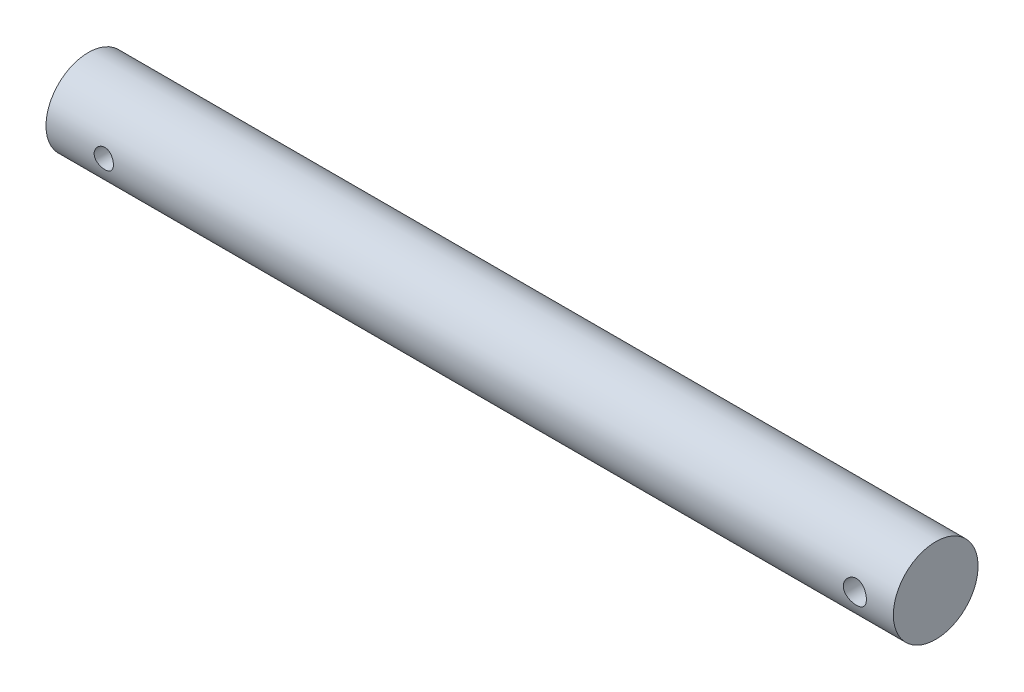
ISO-10303-21;
HEADER;
FILE_DESCRIPTION(('STEP AP214'),'2;1');
FILE_NAME('part.step','',(''),(''),'','','');
FILE_SCHEMA(('AUTOMOTIVE_DESIGN { 1 0 10303 214 1 1 1 1 }'));
ENDSEC;
DATA;
#1=APPLICATION_CONTEXT('core data for automotive mechanical design processes');
#2=APPLICATION_PROTOCOL_DEFINITION('international standard','automotive_design',2000,#1);
#3=PRODUCT_CONTEXT('',#1,'mechanical');
#4=PRODUCT('Part','Part','',(#3));
#5=PRODUCT_RELATED_PRODUCT_CATEGORY('part','',(#4));
#6=PRODUCT_DEFINITION_FORMATION('','',#4);
#7=PRODUCT_DEFINITION_CONTEXT('part definition',#1,'design');
#8=PRODUCT_DEFINITION('design','',#6,#7);
#9=PRODUCT_DEFINITION_SHAPE('','',#8);
#10=(LENGTH_UNIT() NAMED_UNIT(*) SI_UNIT(.MILLI.,.METRE.));
#11=(NAMED_UNIT(*) PLANE_ANGLE_UNIT() SI_UNIT($,.RADIAN.));
#12=(NAMED_UNIT(*) SI_UNIT($,.STERADIAN.) SOLID_ANGLE_UNIT());
#13=UNCERTAINTY_MEASURE_WITH_UNIT(LENGTH_MEASURE(1.E-05),#10,'distance_accuracy_value','');
#14=(GEOMETRIC_REPRESENTATION_CONTEXT(3) GLOBAL_UNCERTAINTY_ASSIGNED_CONTEXT((#13)) GLOBAL_UNIT_ASSIGNED_CONTEXT((#10,
#11,#12)) REPRESENTATION_CONTEXT('',''));
#15=CARTESIAN_POINT('',(0.,0.,0.));
#16=DIRECTION('',(0.,0.,1.));
#17=DIRECTION('',(1.,0.,0.));
#18=AXIS2_PLACEMENT_3D('',#15,#16,#17);
#19=CARTESIAN_POINT('',(0.,0.,0.));
#20=DIRECTION('',(-1.,0.,0.));
#21=DIRECTION('',(0.,0.,1.));
#22=AXIS2_PLACEMENT_3D('',#19,#20,#21);
#23=PLANE('',#22);
#24=CARTESIAN_POINT('',(0.,0.,0.));
#25=DIRECTION('',(-1.,0.,0.));
#26=DIRECTION('',(0.,0.,1.));
#27=AXIS2_PLACEMENT_3D('',#24,#25,#26);
#28=CIRCLE('',#27,11.);
#29=CARTESIAN_POINT('',(0.,0.,11.));
#30=VERTEX_POINT('',#29);
#31=EDGE_CURVE('E56',#30,#30,#28,.T.);
#32=ORIENTED_EDGE('',*,*,#31,.F.);
#33=EDGE_LOOP('',(#32));
#34=FACE_BOUND('',#33,.T.);
#35=ADVANCED_FACE('F36',(#34),#23,.F.);
#36=CARTESIAN_POINT('',(-220.,0.,0.));
#37=DIRECTION('',(-1.,0.,0.));
#38=DIRECTION('',(0.,0.,1.));
#39=AXIS2_PLACEMENT_3D('',#36,#37,#38);
#40=CYLINDRICAL_SURFACE('',#39,11.);
#41=CARTESIAN_POINT('',(-202.5,0.,-11.));
#42=CARTESIAN_POINT('',(-202.500004531826,0.138518278596904,-10.9999974735185));
#43=CARTESIAN_POINT('',(-202.511551227577,0.277090172258006,-10.9973570934613));
#44=CARTESIAN_POINT('',(-202.557379476062,0.550288594599321,-10.987079320306));
#45=CARTESIAN_POINT('',(-202.591676395955,0.68491239222073,-10.9794385496265));
#46=CARTESIAN_POINT('',(-202.681868048632,0.946227671984913,-10.9600095312294));
#47=CARTESIAN_POINT('',(-202.737739327981,1.07292759495647,-10.9482257885674));
#48=CARTESIAN_POINT('',(-202.869417113381,1.31515227582565,-10.921778201627));
#49=CARTESIAN_POINT('',(-202.945223420842,1.43067714503182,-10.9071143860398));
#50=CARTESIAN_POINT('',(-203.116002044607,1.64926760444638,-10.8762265816814));
#51=CARTESIAN_POINT('',(-203.211252573475,1.75211293892049,-10.8599819758326));
#52=CARTESIAN_POINT('',(-203.417618974137,1.9405138981661,-10.827906511833));
#53=CARTESIAN_POINT('',(-203.528736350694,2.02606788121783,-10.8120756930933));
#54=CARTESIAN_POINT('',(-203.765332055284,2.17844599401787,-10.7824158369221));
#55=CARTESIAN_POINT('',(-203.890966996306,2.24503254356575,-10.7686131580577));
#56=CARTESIAN_POINT('',(-204.152009500582,2.3560606971787,-10.7448696147508));
#57=CARTESIAN_POINT('',(-204.287415792062,2.40050517717749,-10.7349282488168));
#58=CARTESIAN_POINT('',(-204.561759187117,2.46525349412718,-10.720243446983));
#59=CARTESIAN_POINT('',(-204.700599263123,2.48594892680754,-10.715415797339));
#60=CARTESIAN_POINT('',(-204.979858227213,2.50382988451486,-10.7112523406768));
#61=CARTESIAN_POINT('',(-205.120276902662,2.50101853886552,-10.711915802658));
#62=CARTESIAN_POINT('',(-205.395772883349,2.47228016958762,-10.7185835035919));
#63=CARTESIAN_POINT('',(-205.530900906195,2.44681104599437,-10.7244819412975));
#64=CARTESIAN_POINT('',(-205.794914486155,2.37420684920502,-10.7407873672743));
#65=CARTESIAN_POINT('',(-205.923799667627,2.32707047404288,-10.7511946264744));
#66=CARTESIAN_POINT('',(-206.172940671811,2.21205734402544,-10.7754474384537));
#67=CARTESIAN_POINT('',(-206.293113517764,2.14400712086008,-10.7893215597825));
#68=CARTESIAN_POINT('',(-206.520502553111,1.98921977920407,-10.8189276843241));
#69=CARTESIAN_POINT('',(-206.627716840264,1.90247992237133,-10.8346599596346));
#70=CARTESIAN_POINT('',(-206.828778561821,1.71036518003515,-10.8666615287251));
#71=CARTESIAN_POINT('',(-206.922254426516,1.60460166742827,-10.882934773515));
#72=CARTESIAN_POINT('',(-207.090205888707,1.37871229840973,-10.9138502597158));
#73=CARTESIAN_POINT('',(-207.164681086699,1.25858614009081,-10.9284924668293));
#74=CARTESIAN_POINT('',(-207.292620387972,1.00690799179916,-10.9545497424637));
#75=CARTESIAN_POINT('',(-207.346032773622,0.875328834348164,-10.9659568484873));
#76=CARTESIAN_POINT('',(-207.429884005868,0.604745122491703,-10.9841998956698));
#77=CARTESIAN_POINT('',(-207.460326465822,0.465741739663724,-10.9910365557784));
#78=CARTESIAN_POINT('',(-207.496826237473,0.187439840192735,-10.9992650071756));
#79=CARTESIAN_POINT('',(-207.503390691317,0.0482110923370403,-11.0007700184113));
#80=CARTESIAN_POINT('',(-207.493326960147,-0.229353886680102,-10.9984842255063));
#81=CARTESIAN_POINT('',(-207.476700480594,-0.367690182720858,-10.9946938107912));
#82=CARTESIAN_POINT('',(-207.421146833095,-0.637841677218453,-10.9823148103741));
#83=CARTESIAN_POINT('',(-207.382488453556,-0.769715036814415,-10.973784087055));
#84=CARTESIAN_POINT('',(-207.284268972543,-1.02510393087759,-10.9528806132367));
#85=CARTESIAN_POINT('',(-207.224705995747,-1.14861871432288,-10.9405075180554));
#86=CARTESIAN_POINT('',(-207.085330856445,-1.38586085256054,-10.9130143275095));
#87=CARTESIAN_POINT('',(-207.005224373227,-1.49941068522717,-10.8978552985532));
#88=CARTESIAN_POINT('',(-206.82742067156,-1.7116377357905,-10.866546095646));
#89=CARTESIAN_POINT('',(-206.729720973453,-1.81031285357968,-10.8503957821912));
#90=CARTESIAN_POINT('',(-206.517169034867,-1.99201706218094,-10.8185287714487));
#91=CARTESIAN_POINT('',(-206.402012758213,-2.0746936659406,-10.8028272119253));
#92=CARTESIAN_POINT('',(-206.15915360933,-2.21953814406551,-10.7740023321604));
#93=CARTESIAN_POINT('',(-206.03145129204,-2.28170692501016,-10.7608788979592));
#94=CARTESIAN_POINT('',(-205.767819530431,-2.38333597241927,-10.7388274870673));
#95=CARTESIAN_POINT('',(-205.631942676257,-2.42292716221704,-10.7298753781702));
#96=CARTESIAN_POINT('',(-205.355233093301,-2.47865258340364,-10.7171411058581));
#97=CARTESIAN_POINT('',(-205.214401234864,-2.49479091341613,-10.7133580391079));
#98=CARTESIAN_POINT('',(-204.935341380689,-2.50296739214164,-10.7114502943222));
#99=CARTESIAN_POINT('',(-204.797130400666,-2.4955654850107,-10.7131941458177));
#100=CARTESIAN_POINT('',(-204.523981089812,-2.45813115403283,-10.7218446846914));
#101=CARTESIAN_POINT('',(-204.38904271389,-2.42809904217009,-10.7287513008948));
#102=CARTESIAN_POINT('',(-204.126756602634,-2.34653692360609,-10.7468826027048));
#103=CARTESIAN_POINT('',(-203.999380308859,-2.29509457527995,-10.758089666867));
#104=CARTESIAN_POINT('',(-203.754985293099,-2.1722453660688,-10.783564723281));
#105=CARTESIAN_POINT('',(-203.637967749675,-2.10083623731223,-10.7978330631966));
#106=CARTESIAN_POINT('',(-203.414865572345,-1.93824996891049,-10.828211072634));
#107=CARTESIAN_POINT('',(-203.309074277793,-1.84667645642834,-10.8443540558786));
#108=CARTESIAN_POINT('',(-203.114176814918,-1.64715628932417,-10.8764454859305));
#109=CARTESIAN_POINT('',(-203.025074529034,-1.53920583540675,-10.8923938866664));
#110=CARTESIAN_POINT('',(-202.864861939766,-1.30814060515056,-10.9225693389041));
#111=CARTESIAN_POINT('',(-202.794026176667,-1.1848316218762,-10.9367686161711));
#112=CARTESIAN_POINT('',(-202.674200029337,-0.927755967711689,-10.9615640551399));
#113=CARTESIAN_POINT('',(-202.625192005213,-0.79399784433769,-10.9721631246672));
#114=CARTESIAN_POINT('',(-202.558772093824,-0.550163071539617,-10.9867559512784));
#115=CARTESIAN_POINT('',(-202.536776012311,-0.441368111138487,-10.9916908558499));
#116=CARTESIAN_POINT('',(-202.507388526421,-0.221726814930917,-10.9983138080737));
#117=CARTESIAN_POINT('',(-202.499996372381,-0.110880584717101,-11.0000020223883));
#118=CARTESIAN_POINT('',(-202.5,0.,-11.));
#119=B_SPLINE_CURVE_WITH_KNOTS('',3,(#41,#42,#43,#44,#45,#46,#47,#48,#49,#50,#51,#52,#53,#54,
#55,#56,#57,#58,#59,#60,#61,#62,#63,#64,#65,#66,#67,#68,#69,#70,#71,#72,#73,#74,#75,#76,#77,#78,
#79,#80,#81,#82,#83,#84,#85,#86,#87,#88,#89,#90,#91,#92,#93,#94,#95,#96,#97,#98,#99,#100,#101,
#102,#103,#104,#105,#106,#107,#108,#109,#110,#111,#112,#113,#114,#115,#116,#117,#118),
.UNSPECIFIED.,.T.,.F.,(4,2,2,2,2,2,2,2,2,2,2,2,2,2,2,2,2,2,2,2,2,2,2,2,2,2,2,2,2,2,2,2,2,2,2,2,
2,2,4),(0.,0.415148849633314,0.830578406996924,1.24555761755317,1.66053269430524,
2.0819238939681,2.50335508365802,2.92985362973416,3.35629676538241,3.77560244898085,
4.19485231368757,4.60581714174232,5.01680666753967,5.4313015743885,5.84585725297978,
6.27011531803702,6.69438230269861,7.11968464096645,7.54492006169893,7.9610694191676,
8.37718817463625,8.78833576149032,9.19952024123082,9.61696129328761,10.0344612272567,
10.4603132154039,10.8861463755947,11.3094844190899,11.7327484710939,12.1460204395145,
12.5592867105953,12.9708773657614,13.382514789318,13.8031102578591,14.2238034502006,
14.6504927745346,15.0768366452215,15.4091704772436,15.74148724914),.UNSPECIFIED.);
#120=CARTESIAN_POINT('',(-202.5,0.,-11.));
#121=VERTEX_POINT('',#120);
#122=EDGE_CURVE('E109',#121,#121,#119,.T.);
#123=ORIENTED_EDGE('',*,*,#122,.T.);
#124=EDGE_LOOP('',(#123));
#125=FACE_BOUND('',#124,.T.);
#126=CARTESIAN_POINT('',(-202.5,0.,11.));
#127=CARTESIAN_POINT('',(-202.500004531826,-0.138518278596904,10.9999974735185));
#128=CARTESIAN_POINT('',(-202.511551227577,-0.277090172258005,10.9973570934613));
#129=CARTESIAN_POINT('',(-202.557379476062,-0.55028859459932,10.987079320306));
#130=CARTESIAN_POINT('',(-202.591676395955,-0.684912392220729,10.9794385496265));
#131=CARTESIAN_POINT('',(-202.681868048632,-0.946227671984913,10.9600095312294));
#132=CARTESIAN_POINT('',(-202.737739327981,-1.07292759495646,10.9482257885674));
#133=CARTESIAN_POINT('',(-202.869417113381,-1.31515227582565,10.921778201627));
#134=CARTESIAN_POINT('',(-202.945223420842,-1.43067714503182,10.9071143860398));
#135=CARTESIAN_POINT('',(-203.116002044607,-1.64926760444638,10.8762265816814));
#136=CARTESIAN_POINT('',(-203.211252573475,-1.75211293892049,10.8599819758326));
#137=CARTESIAN_POINT('',(-203.417618974137,-1.9405138981661,10.827906511833));
#138=CARTESIAN_POINT('',(-203.528736350694,-2.02606788121783,10.8120756930933));
#139=CARTESIAN_POINT('',(-203.765332055284,-2.17844599401787,10.7824158369221));
#140=CARTESIAN_POINT('',(-203.890966996306,-2.24503254356575,10.7686131580577));
#141=CARTESIAN_POINT('',(-204.152009500582,-2.3560606971787,10.7448696147508));
#142=CARTESIAN_POINT('',(-204.287415792062,-2.40050517717749,10.7349282488168));
#143=CARTESIAN_POINT('',(-204.561759187117,-2.46525349412718,10.720243446983));
#144=CARTESIAN_POINT('',(-204.700599263123,-2.48594892680753,10.715415797339));
#145=CARTESIAN_POINT('',(-204.979858227213,-2.50382988451486,10.7112523406768));
#146=CARTESIAN_POINT('',(-205.120276902662,-2.50101853886552,10.711915802658));
#147=CARTESIAN_POINT('',(-205.395772883349,-2.47228016958762,10.7185835035919));
#148=CARTESIAN_POINT('',(-205.530900906195,-2.44681104599437,10.7244819412975));
#149=CARTESIAN_POINT('',(-205.794914486155,-2.37420684920502,10.7407873672743));
#150=CARTESIAN_POINT('',(-205.923799667627,-2.32707047404288,10.7511946264744));
#151=CARTESIAN_POINT('',(-206.172940671811,-2.21205734402544,10.7754474384537));
#152=CARTESIAN_POINT('',(-206.293113517764,-2.14400712086008,10.7893215597825));
#153=CARTESIAN_POINT('',(-206.520502553111,-1.98921977920407,10.8189276843241));
#154=CARTESIAN_POINT('',(-206.627716840264,-1.90247992237133,10.8346599596346));
#155=CARTESIAN_POINT('',(-206.828778561821,-1.71036518003515,10.8666615287251));
#156=CARTESIAN_POINT('',(-206.922254426516,-1.60460166742826,10.882934773515));
#157=CARTESIAN_POINT('',(-207.090205888707,-1.37871229840971,10.9138502597158));
#158=CARTESIAN_POINT('',(-207.164681086699,-1.2585861400908,10.9284924668293));
#159=CARTESIAN_POINT('',(-207.292620387972,-1.00690799179917,10.9545497424637));
#160=CARTESIAN_POINT('',(-207.346032773622,-0.875328834348171,10.9659568484873));
#161=CARTESIAN_POINT('',(-207.429884005868,-0.604745122491709,10.9841998956698));
#162=CARTESIAN_POINT('',(-207.460326465822,-0.465741739663728,10.9910365557784));
#163=CARTESIAN_POINT('',(-207.496826237473,-0.187439840192736,10.9992650071756));
#164=CARTESIAN_POINT('',(-207.503390691317,-0.0482110923370412,11.0007700184113));
#165=CARTESIAN_POINT('',(-207.493326960147,0.229353886680101,10.9984842255063));
#166=CARTESIAN_POINT('',(-207.476700480594,0.367690182720856,10.9946938107912));
#167=CARTESIAN_POINT('',(-207.421146833095,0.637841677218452,10.9823148103741));
#168=CARTESIAN_POINT('',(-207.382488453556,0.769715036814414,10.973784087055));
#169=CARTESIAN_POINT('',(-207.284268972543,1.02510393087759,10.9528806132367));
#170=CARTESIAN_POINT('',(-207.224705995747,1.14861871432288,10.9405075180554));
#171=CARTESIAN_POINT('',(-207.085330856445,1.38586085256054,10.9130143275095));
#172=CARTESIAN_POINT('',(-207.005224373227,1.49941068522717,10.8978552985532));
#173=CARTESIAN_POINT('',(-206.82742067156,1.7116377357905,10.866546095646));
#174=CARTESIAN_POINT('',(-206.729720973453,1.81031285357968,10.8503957821912));
#175=CARTESIAN_POINT('',(-206.517169034867,1.99201706218094,10.8185287714487));
#176=CARTESIAN_POINT('',(-206.402012758213,2.0746936659406,10.8028272119253));
#177=CARTESIAN_POINT('',(-206.15915360933,2.21953814406551,10.7740023321604));
#178=CARTESIAN_POINT('',(-206.03145129204,2.28170692501016,10.7608788979592));
#179=CARTESIAN_POINT('',(-205.767819530431,2.38333597241927,10.7388274870673));
#180=CARTESIAN_POINT('',(-205.631942676257,2.42292716221704,10.7298753781702));
#181=CARTESIAN_POINT('',(-205.355233093301,2.47865258340364,10.7171411058581));
#182=CARTESIAN_POINT('',(-205.214401234864,2.49479091341613,10.7133580391079));
#183=CARTESIAN_POINT('',(-204.935341380689,2.50296739214164,10.7114502943222));
#184=CARTESIAN_POINT('',(-204.797130400666,2.4955654850107,10.7131941458177));
#185=CARTESIAN_POINT('',(-204.523981089812,2.45813115403283,10.7218446846914));
#186=CARTESIAN_POINT('',(-204.38904271389,2.42809904217009,10.7287513008948));
#187=CARTESIAN_POINT('',(-204.126756602634,2.3465369236061,10.7468826027048));
#188=CARTESIAN_POINT('',(-203.999380308859,2.29509457527996,10.758089666867));
#189=CARTESIAN_POINT('',(-203.754985293099,2.17224536606882,10.783564723281));
#190=CARTESIAN_POINT('',(-203.637967749675,2.10083623731225,10.7978330631966));
#191=CARTESIAN_POINT('',(-203.414865572345,1.9382499689105,10.828211072634));
#192=CARTESIAN_POINT('',(-203.309074277793,1.84667645642835,10.8443540558786));
#193=CARTESIAN_POINT('',(-203.114176814918,1.64715628932418,10.8764454859305));
#194=CARTESIAN_POINT('',(-203.025074529034,1.53920583540676,10.8923938866664));
#195=CARTESIAN_POINT('',(-202.864861939766,1.30814060515057,10.9225693389041));
#196=CARTESIAN_POINT('',(-202.794026176667,1.1848316218762,10.9367686161711));
#197=CARTESIAN_POINT('',(-202.674200029337,0.92775596771169,10.9615640551399));
#198=CARTESIAN_POINT('',(-202.625192005213,0.793997844337691,10.9721631246672));
#199=CARTESIAN_POINT('',(-202.558772093824,0.550163071539618,10.9867559512784));
#200=CARTESIAN_POINT('',(-202.536776012311,0.441368111138487,10.9916908558498));
#201=CARTESIAN_POINT('',(-202.507388526421,0.221726814930917,10.9983138080737));
#202=CARTESIAN_POINT('',(-202.499996372381,0.110880584717101,11.0000020223883));
#203=CARTESIAN_POINT('',(-202.5,0.,11.));
#204=B_SPLINE_CURVE_WITH_KNOTS('',3,(#126,#127,#128,#129,#130,#131,#132,#133,#134,#135,#136,
#137,#138,#139,#140,#141,#142,#143,#144,#145,#146,#147,#148,#149,#150,#151,#152,#153,#154,#155,
#156,#157,#158,#159,#160,#161,#162,#163,#164,#165,#166,#167,#168,#169,#170,#171,#172,#173,#174,
#175,#176,#177,#178,#179,#180,#181,#182,#183,#184,#185,#186,#187,#188,#189,#190,#191,#192,#193,
#194,#195,#196,#197,#198,#199,#200,#201,#202,#203),.UNSPECIFIED.,.T.,.F.,(4,2,2,2,2,2,2,2,2,2,2,
2,2,2,2,2,2,2,2,2,2,2,2,2,2,2,2,2,2,2,2,2,2,2,2,2,2,2,4),(0.,0.415148849633314,
0.830578406996924,1.24555761755317,1.66053269430524,2.0819238939681,2.50335508365802,
2.92985362973416,3.35629676538241,3.77560244898082,4.19485231368757,4.60581714174232,
5.01680666753967,5.4313015743885,5.84585725297978,6.27011531803703,6.6943823026986,
7.11968464096644,7.54492006169893,7.9610694191676,8.37718817463625,8.78833576149032,
9.19952024123081,9.61696129328761,10.0344612272567,10.4603132154039,10.8861463755947,
11.3094844190899,11.7327484710939,12.1460204395145,12.5592867105953,12.9708773657614,
13.382514789318,13.803110257859,14.2238034502006,14.6504927745346,15.0768366452215,
15.4091704772435,15.74148724914),.UNSPECIFIED.);
#205=CARTESIAN_POINT('',(-202.5,0.,11.));
#206=VERTEX_POINT('',#205);
#207=EDGE_CURVE('E119',#206,#206,#204,.T.);
#208=ORIENTED_EDGE('',*,*,#207,.T.);
#209=EDGE_LOOP('',(#208));
#210=FACE_BOUND('',#209,.T.);
#211=CARTESIAN_POINT('',(-6.99999999999999,0.,-11.));
#212=CARTESIAN_POINT('',(-7.00000362522205,0.165241826664387,-10.9999976543482));
#213=CARTESIAN_POINT('',(-7.01369812716682,0.330521957625416,-10.9962401452152));
#214=CARTESIAN_POINT('',(-7.06801166060635,0.656311860315395,-10.981615961709));
#215=CARTESIAN_POINT('',(-7.10864278325719,0.81681945595453,-10.97074609481));
#216=CARTESIAN_POINT('',(-7.21540346347684,1.12831525211079,-10.9430954434827));
#217=CARTESIAN_POINT('',(-7.28149930532382,1.27931573394033,-10.9263224773879));
#218=CARTESIAN_POINT('',(-7.43718586532484,1.56808899231944,-10.8886330882569));
#219=CARTESIAN_POINT('',(-7.52677843270785,1.70586072657955,-10.8677163391303));
#220=CARTESIAN_POINT('',(-7.72919967293452,1.96759389514652,-10.8234279408412));
#221=CARTESIAN_POINT('',(-7.8424908817084,2.09119025833987,-10.8000128298086));
#222=CARTESIAN_POINT('',(-8.0881052720598,2.31788587364956,-10.7536422587012));
#223=CARTESIAN_POINT('',(-8.22043102080462,2.42098235649443,-10.7306868611041));
#224=CARTESIAN_POINT('',(-8.50330249515894,2.60555589078995,-10.6873876832732));
#225=CARTESIAN_POINT('',(-8.65413428987255,2.68660853675173,-10.6670986011725));
#226=CARTESIAN_POINT('',(-8.96792765639874,2.82205832722455,-10.6320701482383));
#227=CARTESIAN_POINT('',(-9.13088686977697,2.87646063893688,-10.6173297017151));
#228=CARTESIAN_POINT('',(-9.46025579002493,2.95578912882536,-10.5955169438548));
#229=CARTESIAN_POINT('',(-9.62649389632383,2.98137921086458,-10.5882722456757));
#230=CARTESIAN_POINT('',(-9.96104936601761,3.00442728818267,-10.5817565816816));
#231=CARTESIAN_POINT('',(-10.129366315,3.00189080281765,-10.5824840514652));
#232=CARTESIAN_POINT('',(-10.4580831019325,2.96928383560602,-10.5916764975091));
#233=CARTESIAN_POINT('',(-10.6185704692045,2.94002147337865,-10.5999143662734));
#234=CARTESIAN_POINT('',(-10.9322665720456,2.85608967743614,-10.6228351158812));
#235=CARTESIAN_POINT('',(-11.0854747009326,2.80141813009295,-10.637518532883));
#236=CARTESIAN_POINT('',(-11.3823470410949,2.66757259652941,-10.6718723658465));
#237=CARTESIAN_POINT('',(-11.5258784020672,2.58811903765895,-10.6915991952828));
#238=CARTESIAN_POINT('',(-11.7978528948193,2.40715976044348,-10.7337873759558));
#239=CARTESIAN_POINT('',(-11.9262929256775,2.30564952212418,-10.756249287265));
#240=CARTESIAN_POINT('',(-12.1690503796129,2.07934693365792,-10.8023178998121));
#241=CARTESIAN_POINT('',(-12.2827348985779,1.9538772923345,-10.8259374859423));
#242=CARTESIAN_POINT('',(-12.4875819299556,1.68536402357727,-10.8709729541596));
#243=CARTESIAN_POINT('',(-12.5787434720992,1.54231963943711,-10.8923887412858));
#244=CARTESIAN_POINT('',(-12.7362533455498,1.24170790747925,-10.9307455624252));
#245=CARTESIAN_POINT('',(-12.8024826771679,1.08407527483555,-10.9476650257461));
#246=CARTESIAN_POINT('',(-12.9073159450283,0.759345377428781,-10.9749671228522));
#247=CARTESIAN_POINT('',(-12.9459262048883,0.592250288635364,-10.9853512528913));
#248=CARTESIAN_POINT('',(-12.9934212355939,0.258736340966502,-10.9981845755262));
#249=CARTESIAN_POINT('',(-13.0031659906407,0.0924485955679605,-11.0008632625074));
#250=CARTESIAN_POINT('',(-12.9950345049731,-0.239386731275947,-10.9986460317027));
#251=CARTESIAN_POINT('',(-12.977161260767,-0.404934391065018,-10.9937509356601));
#252=CARTESIAN_POINT('',(-12.9150049945937,-0.727490195479109,-10.977084785319));
#253=CARTESIAN_POINT('',(-12.871205614486,-0.884598648545339,-10.9654397294419));
#254=CARTESIAN_POINT('',(-12.759005510719,-1.18921973489728,-10.9365984707135));
#255=CARTESIAN_POINT('',(-12.6906020606773,-1.33673130261004,-10.9194016526918));
#256=CARTESIAN_POINT('',(-12.5295671154288,-1.62128232238913,-10.8808314765631));
#257=CARTESIAN_POINT('',(-12.4364730254774,-1.75804920482497,-10.8593805909887));
#258=CARTESIAN_POINT('',(-12.229277424909,-2.01432044026184,-10.8147797682096));
#259=CARTESIAN_POINT('',(-12.1151715676829,-2.133821212356,-10.7916294800542));
#260=CARTESIAN_POINT('',(-11.8651719239324,-2.35582120688549,-10.7453880311357));
#261=CARTESIAN_POINT('',(-11.7287332354501,-2.45771255494154,-10.7223188995483));
#262=CARTESIAN_POINT('',(-11.4402027055534,-2.63717164416209,-10.6796005238856));
#263=CARTESIAN_POINT('',(-11.2881114907549,-2.71474035852927,-10.6599511429925));
#264=CARTESIAN_POINT('',(-10.9733187435356,-2.84277116633766,-10.6265249735947));
#265=CARTESIAN_POINT('',(-10.8106834790394,-2.8933870461064,-10.6127149622546));
#266=CARTESIAN_POINT('',(-10.4787663240444,-2.9664183443807,-10.5925362923412));
#267=CARTESIAN_POINT('',(-10.3094862409314,-2.98884137725659,-10.586165624571));
#268=CARTESIAN_POINT('',(-9.97532319232942,-3.00439791154423,-10.5817601934995));
#269=CARTESIAN_POINT('',(-9.81048882250415,-2.99851066433394,-10.5834467188085));
#270=CARTESIAN_POINT('',(-9.48425870449437,-2.95989675286934,-10.5943100332908));
#271=CARTESIAN_POINT('',(-9.32286286010058,-2.92717084057027,-10.6034866126106));
#272=CARTESIAN_POINT('',(-9.00938736846222,-2.83638816870609,-10.6281263302191));
#273=CARTESIAN_POINT('',(-8.85724049352036,-2.77854790898354,-10.6435356626191));
#274=CARTESIAN_POINT('',(-8.56469344636944,-2.63934609082672,-10.6789037996565));
#275=CARTESIAN_POINT('',(-8.4242951978686,-2.55798069008885,-10.6988633473566));
#276=CARTESIAN_POINT('',(-8.15457880461579,-2.37110861969731,-10.7418475876651));
#277=CARTESIAN_POINT('',(-8.02573259031406,-2.26493803644257,-10.7649475169129));
#278=CARTESIAN_POINT('',(-7.78736718641049,-2.0327202239854,-10.8111998098094));
#279=CARTESIAN_POINT('',(-7.67785275198925,-1.90666811877597,-10.834352184944));
#280=CARTESIAN_POINT('',(-7.47881077096126,-1.63481545137218,-10.8787291835493));
#281=CARTESIAN_POINT('',(-7.38979303826606,-1.48863173252504,-10.8998981550767));
#282=CARTESIAN_POINT('',(-7.23773512757702,-1.18279979967855,-10.9373052756075));
#283=CARTESIAN_POINT('',(-7.17467903889133,-1.02315990484244,-10.9535464430238));
#284=CARTESIAN_POINT('',(-7.08412098004201,-0.720200202436422,-10.9772838799153));
#285=CARTESIAN_POINT('',(-7.05265089751659,-0.578129280524935,-10.9857389536218));
#286=CARTESIAN_POINT('',(-7.01058994936234,-0.290715215882967,-10.997097743287));
#287=CARTESIAN_POINT('',(-6.9999968106904,-0.145372431129893,-11.0000020636004));
#288=CARTESIAN_POINT('',(-6.99999999999999,0.,-11.));
#289=B_SPLINE_CURVE_WITH_KNOTS('',3,(#211,#212,#213,#214,#215,#216,#217,#218,#219,#220,#221,
#222,#223,#224,#225,#226,#227,#228,#229,#230,#231,#232,#233,#234,#235,#236,#237,#238,#239,#240,
#241,#242,#243,#244,#245,#246,#247,#248,#249,#250,#251,#252,#253,#254,#255,#256,#257,#258,#259,
#260,#261,#262,#263,#264,#265,#266,#267,#268,#269,#270,#271,#272,#273,#274,#275,#276,#277,#278,
#279,#280,#281,#282,#283,#284,#285,#286,#287,#288),.UNSPECIFIED.,.T.,.F.,(4,2,2,2,2,2,2,2,2,2,2,
2,2,2,2,2,2,2,2,2,2,2,2,2,2,2,2,2,2,2,2,2,2,2,2,2,2,2,4),(0.,0.495192213709794,0.9906068571026,
1.48536780484116,1.98016770272941,2.48571756446357,2.99133567318647,3.50609187300439,
4.02074822781993,4.52328609721851,5.02572535393076,5.51345773349774,6.00123069167434,
6.49471853535856,6.98830760278243,7.4987705710155,8.00925552568848,8.52214699472057,
9.03492099533888,9.53225622686166,10.029537502105,10.5178222240039,11.0061610695167,
11.5043893801936,12.0027208731201,12.5158014612974,13.0288615173582,13.5389619291417,
14.0489245425547,14.5413770446734,15.0338157499215,15.5220911132461,16.0104462704815,
16.5137802279716,17.0172378222293,17.532117445911,18.0466810522785,18.4823766419936,
18.9180247913559),.UNSPECIFIED.);
#290=CARTESIAN_POINT('',(-6.99999999999999,0.,-11.));
#291=VERTEX_POINT('',#290);
#292=EDGE_CURVE('E10',#291,#291,#289,.T.);
#293=ORIENTED_EDGE('',*,*,#292,.T.);
#294=EDGE_LOOP('',(#293));
#295=FACE_BOUND('',#294,.T.);
#296=CARTESIAN_POINT('',(-6.99999999999999,0.,11.));
#297=CARTESIAN_POINT('',(-7.00000362522205,-0.165241826664387,10.9999976543482));
#298=CARTESIAN_POINT('',(-7.01369812716682,-0.330521957625415,10.9962401452152));
#299=CARTESIAN_POINT('',(-7.06801166060635,-0.656311860315394,10.981615961709));
#300=CARTESIAN_POINT('',(-7.10864278325719,-0.816819455954529,10.97074609481));
#301=CARTESIAN_POINT('',(-7.21540346347684,-1.12831525211079,10.9430954434827));
#302=CARTESIAN_POINT('',(-7.28149930532382,-1.27931573394033,10.9263224773879));
#303=CARTESIAN_POINT('',(-7.43718586532484,-1.56808899231944,10.8886330882569));
#304=CARTESIAN_POINT('',(-7.52677843270785,-1.70586072657955,10.8677163391303));
#305=CARTESIAN_POINT('',(-7.72919967293451,-1.96759389514652,10.8234279408412));
#306=CARTESIAN_POINT('',(-7.8424908817084,-2.09119025833987,10.8000128298086));
#307=CARTESIAN_POINT('',(-8.0881052720598,-2.31788587364956,10.7536422587012));
#308=CARTESIAN_POINT('',(-8.22043102080462,-2.42098235649443,10.7306868611041));
#309=CARTESIAN_POINT('',(-8.50330249515894,-2.60555589078995,10.6873876832732));
#310=CARTESIAN_POINT('',(-8.65413428987254,-2.68660853675173,10.6670986011725));
#311=CARTESIAN_POINT('',(-8.96792765639874,-2.82205832722455,10.6320701482383));
#312=CARTESIAN_POINT('',(-9.13088686977697,-2.87646063893688,10.6173297017151));
#313=CARTESIAN_POINT('',(-9.46025579002493,-2.95578912882536,10.5955169438548));
#314=CARTESIAN_POINT('',(-9.62649389632383,-2.98137921086458,10.5882722456757));
#315=CARTESIAN_POINT('',(-9.96104936601761,-3.00442728818267,10.5817565816816));
#316=CARTESIAN_POINT('',(-10.129366315,-3.00189080281765,10.5824840514652));
#317=CARTESIAN_POINT('',(-10.4580831019325,-2.96928383560602,10.5916764975091));
#318=CARTESIAN_POINT('',(-10.6185704692045,-2.94002147337865,10.5999143662734));
#319=CARTESIAN_POINT('',(-10.9322665720456,-2.85608967743614,10.6228351158812));
#320=CARTESIAN_POINT('',(-11.0854747009326,-2.80141813009295,10.637518532883));
#321=CARTESIAN_POINT('',(-11.3823470410949,-2.66757259652941,10.6718723658465));
#322=CARTESIAN_POINT('',(-11.5258784020672,-2.58811903765895,10.6915991952828));
#323=CARTESIAN_POINT('',(-11.7978528948193,-2.40715976044348,10.7337873759558));
#324=CARTESIAN_POINT('',(-11.9262929256775,-2.30564952212418,10.756249287265));
#325=CARTESIAN_POINT('',(-12.1690503796129,-2.07934693365792,10.8023178998121));
#326=CARTESIAN_POINT('',(-12.2827348985779,-1.9538772923345,10.8259374859423));
#327=CARTESIAN_POINT('',(-12.4875819299556,-1.68536402357727,10.8709729541596));
#328=CARTESIAN_POINT('',(-12.5787434720992,-1.54231963943711,10.8923887412858));
#329=CARTESIAN_POINT('',(-12.7362533455498,-1.24170790747925,10.9307455624252));
#330=CARTESIAN_POINT('',(-12.8024826771679,-1.08407527483555,10.9476650257461));
#331=CARTESIAN_POINT('',(-12.9073159450283,-0.759345377428784,10.9749671228522));
#332=CARTESIAN_POINT('',(-12.9459262048883,-0.592250288635367,10.9853512528913));
#333=CARTESIAN_POINT('',(-12.9934212355939,-0.258736340966503,10.9981845755262));
#334=CARTESIAN_POINT('',(-13.0031659906407,-0.092448595567962,11.0008632625074));
#335=CARTESIAN_POINT('',(-12.9950345049731,0.239386731275946,10.9986460317027));
#336=CARTESIAN_POINT('',(-12.977161260767,0.404934391065017,10.9937509356601));
#337=CARTESIAN_POINT('',(-12.9150049945937,0.727490195479107,10.977084785319));
#338=CARTESIAN_POINT('',(-12.871205614486,0.884598648545338,10.9654397294419));
#339=CARTESIAN_POINT('',(-12.759005510719,1.18921973489727,10.9365984707135));
#340=CARTESIAN_POINT('',(-12.6906020606773,1.33673130261004,10.9194016526918));
#341=CARTESIAN_POINT('',(-12.5295671154288,1.62128232238913,10.8808314765631));
#342=CARTESIAN_POINT('',(-12.4364730254774,1.75804920482497,10.8593805909887));
#343=CARTESIAN_POINT('',(-12.229277424909,2.01432044026183,10.8147797682096));
#344=CARTESIAN_POINT('',(-12.1151715676829,2.133821212356,10.7916294800542));
#345=CARTESIAN_POINT('',(-11.8651719239324,2.35582120688548,10.7453880311357));
#346=CARTESIAN_POINT('',(-11.7287332354501,2.45771255494154,10.7223188995483));
#347=CARTESIAN_POINT('',(-11.4402027055534,2.63717164416208,10.6796005238856));
#348=CARTESIAN_POINT('',(-11.2881114907549,2.71474035852927,10.6599511429925));
#349=CARTESIAN_POINT('',(-10.9733187435356,2.84277116633766,10.6265249735947));
#350=CARTESIAN_POINT('',(-10.8106834790394,2.8933870461064,10.6127149622546));
#351=CARTESIAN_POINT('',(-10.4787663240444,2.9664183443807,10.5925362923412));
#352=CARTESIAN_POINT('',(-10.3094862409314,2.98884137725659,10.586165624571));
#353=CARTESIAN_POINT('',(-9.97532319232942,3.00439791154423,10.5817601934995));
#354=CARTESIAN_POINT('',(-9.81048882250415,2.99851066433394,10.5834467188085));
#355=CARTESIAN_POINT('',(-9.48425870449437,2.95989675286934,10.5943100332908));
#356=CARTESIAN_POINT('',(-9.32286286010058,2.92717084057027,10.6034866126106));
#357=CARTESIAN_POINT('',(-9.00938736846222,2.83638816870609,10.6281263302191));
#358=CARTESIAN_POINT('',(-8.85724049352036,2.77854790898354,10.6435356626191));
#359=CARTESIAN_POINT('',(-8.56469344636944,2.63934609082672,10.6789037996565));
#360=CARTESIAN_POINT('',(-8.4242951978686,2.55798069008886,10.6988633473566));
#361=CARTESIAN_POINT('',(-8.15457880461579,2.37110861969731,10.741847587665));
#362=CARTESIAN_POINT('',(-8.02573259031406,2.26493803644257,10.7649475169129));
#363=CARTESIAN_POINT('',(-7.7873671864105,2.0327202239854,10.8111998098094));
#364=CARTESIAN_POINT('',(-7.67785275198925,1.90666811877597,10.834352184944));
#365=CARTESIAN_POINT('',(-7.47881077096126,1.63481545137218,10.8787291835493));
#366=CARTESIAN_POINT('',(-7.38979303826606,1.48863173252505,10.8998981550767));
#367=CARTESIAN_POINT('',(-7.23773512757702,1.18279979967855,10.9373052756075));
#368=CARTESIAN_POINT('',(-7.17467903889133,1.02315990484244,10.9535464430238));
#369=CARTESIAN_POINT('',(-7.08412098004201,0.720200202436423,10.9772838799153));
#370=CARTESIAN_POINT('',(-7.05265089751659,0.578129280524937,10.9857389536218));
#371=CARTESIAN_POINT('',(-7.01058994936234,0.290715215882968,10.997097743287));
#372=CARTESIAN_POINT('',(-6.9999968106904,0.145372431129894,11.0000020636004));
#373=CARTESIAN_POINT('',(-6.99999999999999,0.,11.));
#374=B_SPLINE_CURVE_WITH_KNOTS('',3,(#296,#297,#298,#299,#300,#301,#302,#303,#304,#305,#306,
#307,#308,#309,#310,#311,#312,#313,#314,#315,#316,#317,#318,#319,#320,#321,#322,#323,#324,#325,
#326,#327,#328,#329,#330,#331,#332,#333,#334,#335,#336,#337,#338,#339,#340,#341,#342,#343,#344,
#345,#346,#347,#348,#349,#350,#351,#352,#353,#354,#355,#356,#357,#358,#359,#360,#361,#362,#363,
#364,#365,#366,#367,#368,#369,#370,#371,#372,#373),.UNSPECIFIED.,.T.,.F.,(4,2,2,2,2,2,2,2,2,2,2,
2,2,2,2,2,2,2,2,2,2,2,2,2,2,2,2,2,2,2,2,2,2,2,2,2,2,2,4),(0.,0.495192213709793,0.9906068571026,
1.48536780484116,1.98016770272941,2.48571756446357,2.99133567318647,3.50609187300438,
4.02074822781993,4.52328609721851,5.02572535393076,5.51345773349774,6.00123069167434,
6.49471853535856,6.98830760278243,7.4987705710155,8.00925552568848,8.52214699472057,
9.03492099533888,9.53225622686166,10.029537502105,10.5178222240039,11.0061610695167,
11.5043893801936,12.0027208731201,12.5158014612974,13.0288615173582,13.5389619291417,
14.0489245425547,14.5413770446734,15.0338157499215,15.5220911132461,16.0104462704815,
16.5137802279716,17.0172378222293,17.532117445911,18.0466810522785,18.4823766419936,
18.9180247913559),.UNSPECIFIED.);
#375=CARTESIAN_POINT('',(-6.99999999999999,0.,11.));
#376=VERTEX_POINT('',#375);
#377=EDGE_CURVE('E49',#376,#376,#374,.T.);
#378=ORIENTED_EDGE('',*,*,#377,.T.);
#379=EDGE_LOOP('',(#378));
#380=FACE_BOUND('',#379,.T.);
#381=CARTESIAN_POINT('',(-220.,0.,0.));
#382=DIRECTION('',(-1.,0.,0.));
#383=DIRECTION('',(0.,0.,1.));
#384=AXIS2_PLACEMENT_3D('',#381,#382,#383);
#385=CIRCLE('',#384,11.);
#386=CARTESIAN_POINT('',(-220.,0.,11.));
#387=VERTEX_POINT('',#386);
#388=EDGE_CURVE('E98',#387,#387,#385,.T.);
#389=ORIENTED_EDGE('',*,*,#388,.F.);
#390=EDGE_LOOP('',(#389));
#391=FACE_BOUND('',#390,.T.);
#392=ORIENTED_EDGE('',*,*,#31,.T.);
#393=EDGE_LOOP('',(#392));
#394=FACE_BOUND('',#393,.T.);
#395=ADVANCED_FACE('F70',(#125,#210,#295,#380,#391,#394),#40,.T.);
#396=CARTESIAN_POINT('',(-220.,11.,0.));
#397=DIRECTION('',(1.,0.,0.));
#398=DIRECTION('',(0.,0.,-1.));
#399=AXIS2_PLACEMENT_3D('',#396,#397,#398);
#400=PLANE('',#399);
#401=CARTESIAN_POINT('',(-220.,0.,0.));
#402=DIRECTION('',(-1.,0.,0.));
#403=DIRECTION('',(0.,0.,1.));
#404=AXIS2_PLACEMENT_3D('',#401,#402,#403);
#405=CIRCLE('',#404,7.);
#406=CARTESIAN_POINT('',(-220.,0.,7.));
#407=VERTEX_POINT('',#406);
#408=EDGE_CURVE('E105',#407,#407,#405,.T.);
#409=ORIENTED_EDGE('',*,*,#408,.F.);
#410=EDGE_LOOP('',(#409));
#411=FACE_BOUND('',#410,.T.);
#412=ORIENTED_EDGE('',*,*,#388,.T.);
#413=EDGE_LOOP('',(#412));
#414=FACE_BOUND('',#413,.T.);
#415=ADVANCED_FACE('F77',(#411,#414),#400,.F.);
#416=CARTESIAN_POINT('',(-9.99999999999999,0.,-11.));
#417=DIRECTION('',(0.,0.,1.));
#418=DIRECTION('',(1.,0.,0.));
#419=AXIS2_PLACEMENT_3D('',#416,#417,#418);
#420=CYLINDRICAL_SURFACE('',#419,3.);
#421=ORIENTED_EDGE('',*,*,#377,.F.);
#422=EDGE_LOOP('',(#421));
#423=FACE_BOUND('',#422,.T.);
#424=ORIENTED_EDGE('',*,*,#292,.F.);
#425=EDGE_LOOP('',(#424));
#426=FACE_BOUND('',#425,.T.);
#427=ADVANCED_FACE('F73',(#423,#426),#420,.F.);
#428=CARTESIAN_POINT('',(-190.,0.,0.));
#429=DIRECTION('',(-1.,0.,0.));
#430=DIRECTION('',(0.,0.,1.));
#431=AXIS2_PLACEMENT_3D('',#428,#429,#430);
#432=CYLINDRICAL_SURFACE('',#431,7.);
#433=CARTESIAN_POINT('',(-202.5,0.,7.));
#434=CARTESIAN_POINT('',(-202.499997175958,0.135839760518734,7.0000020295295));
#435=CARTESIAN_POINT('',(-202.511106757233,0.271659429947532,6.99601056603649));
#436=CARTESIAN_POINT('',(-202.555091287192,0.539264896606897,6.98048404948616));
#437=CARTESIAN_POINT('',(-202.587965405065,0.671050847614626,6.96894928437749));
#438=CARTESIAN_POINT('',(-202.674185141267,0.926692116674318,6.93958109810981));
#439=CARTESIAN_POINT('',(-202.72749355972,1.0505613714592,6.92175912724346));
#440=CARTESIAN_POINT('',(-202.852888719368,1.28759585298402,6.88161078032354));
#441=CARTESIAN_POINT('',(-202.924979959449,1.40075850640075,6.85928332539979));
#442=CARTESIAN_POINT('',(-203.088843132116,1.61758802805346,6.81147377429754));
#443=CARTESIAN_POINT('',(-203.181218731005,1.72078015672851,6.78590827445072));
#444=CARTESIAN_POINT('',(-203.38174636379,1.9105819932243,6.73493522536265));
#445=CARTESIAN_POINT('',(-203.489902583716,1.99718728701347,6.70952771990193));
#446=CARTESIAN_POINT('',(-203.723397792776,2.15423735561843,6.6608007016897));
#447=CARTESIAN_POINT('',(-203.849194743517,2.2240352979483,6.63758107761794));
#448=CARTESIAN_POINT('',(-204.111703664704,2.34127572230002,6.59714352451506));
#449=CARTESIAN_POINT('',(-204.248411714568,2.38872619231546,6.57992345154766));
#450=CARTESIAN_POINT('',(-204.523422836203,2.45809130448527,6.55432038222057));
#451=CARTESIAN_POINT('',(-204.661469306943,2.48090519407331,6.54562733379002));
#452=CARTESIAN_POINT('',(-204.939683631824,2.5031615222748,6.53715061879806));
#453=CARTESIAN_POINT('',(-205.079850692542,2.50261249605974,6.53736369856128));
#454=CARTESIAN_POINT('',(-205.350355655053,2.4788507897233,6.54640588297195));
#455=CARTESIAN_POINT('',(-205.480818353,2.45685161763647,6.5547736366904));
#456=CARTESIAN_POINT('',(-205.736061527183,2.39280851055059,6.57842082174383));
#457=CARTESIAN_POINT('',(-205.860841224651,2.35076183734613,6.59370119723068));
#458=CARTESIAN_POINT('',(-206.103773745786,2.247095668441,6.62975170487814));
#459=CARTESIAN_POINT('',(-206.221769602659,2.18514195933257,6.65061447775041));
#460=CARTESIAN_POINT('',(-206.44605638665,2.04365272690695,6.69544469696369));
#461=CARTESIAN_POINT('',(-206.552343533307,1.96411154980232,6.71941314064672));
#462=CARTESIAN_POINT('',(-206.756959591371,1.78403149047106,6.76952498465894));
#463=CARTESIAN_POINT('',(-206.854417859249,1.68251331515437,6.79571223474351));
#464=CARTESIAN_POINT('',(-207.031171682835,1.46426184534913,6.84605473605516));
#465=CARTESIAN_POINT('',(-207.110464942299,1.34752663019369,6.87020973014028));
#466=CARTESIAN_POINT('',(-207.249480609939,1.10010034292174,6.91416998722002));
#467=CARTESIAN_POINT('',(-207.30893823989,0.9692491124252,6.93391532170415));
#468=CARTESIAN_POINT('',(-207.40471582416,0.698523468127244,6.96639167687355));
#469=CARTESIAN_POINT('',(-207.441045060763,0.558652699053765,6.97912551125635));
#470=CARTESIAN_POINT('',(-207.48791915066,0.281205091813834,6.99566202632136));
#471=CARTESIAN_POINT('',(-207.499638130746,0.143850613169092,6.99987103999093));
#472=CARTESIAN_POINT('',(-207.50034512199,-0.130909371573395,7.00012297890716));
#473=CARTESIAN_POINT('',(-207.489337626992,-0.268314862212673,6.99616751856457));
#474=CARTESIAN_POINT('',(-207.445813862678,-0.534368698997769,6.98080349995239));
#475=CARTESIAN_POINT('',(-207.414045244202,-0.663155848081396,6.96965417819419));
#476=CARTESIAN_POINT('',(-207.330863405264,-0.913499444029989,6.94128245796679));
#477=CARTESIAN_POINT('',(-207.279447634171,-1.03505494970017,6.9240592709991));
#478=CARTESIAN_POINT('',(-207.156841146598,-1.27131790851501,6.88465739573328));
#479=CARTESIAN_POINT('',(-207.085133519501,-1.38573546298722,6.86235262462324));
#480=CARTESIAN_POINT('',(-206.924572504893,-1.6012793689737,6.81528395513799));
#481=CARTESIAN_POINT('',(-206.835713235226,-1.70240114063959,6.79051921453452));
#482=CARTESIAN_POINT('',(-206.637870367271,-1.89402292059753,6.73966040960453));
#483=CARTESIAN_POINT('',(-206.52807528698,-1.98368681906969,6.71356479866296));
#484=CARTESIAN_POINT('',(-206.294458729996,-2.14345525781598,6.6642787599771));
#485=CARTESIAN_POINT('',(-206.170636568871,-2.21355884309555,6.64108847411014));
#486=CARTESIAN_POINT('',(-205.911935190764,-2.33208686094211,6.60040332956607));
#487=CARTESIAN_POINT('',(-205.77704432949,-2.3804881075604,6.58291456759544));
#488=CARTESIAN_POINT('',(-205.50023989928,-2.45361419016748,6.55601442004241));
#489=CARTESIAN_POINT('',(-205.358330179338,-2.4783518546378,6.54659865821929));
#490=CARTESIAN_POINT('',(-205.080479520627,-2.50236255506862,6.53745596427834));
#491=CARTESIAN_POINT('',(-204.944676785576,-2.50304426978181,6.53719306756498));
#492=CARTESIAN_POINT('',(-204.675002329345,-2.48247035008868,6.54503319463773));
#493=CARTESIAN_POINT('',(-204.541130458752,-2.46121642244207,6.55313556754228));
#494=CARTESIAN_POINT('',(-204.282499414628,-2.39843007607192,6.57636700427786));
#495=CARTESIAN_POINT('',(-204.157595900994,-2.35741961008934,6.59131474248996));
#496=CARTESIAN_POINT('',(-203.916357318133,-2.25672644338169,6.6264632931512));
#497=CARTESIAN_POINT('',(-203.800024319056,-2.19703924956893,6.64666536944648));
#498=CARTESIAN_POINT('',(-203.573074250048,-2.05730313071903,6.69127230994833));
#499=CARTESIAN_POINT('',(-203.463011959137,-1.97640371595171,6.71583400336864));
#500=CARTESIAN_POINT('',(-203.25757249534,-1.79790863011922,6.76580411328318));
#501=CARTESIAN_POINT('',(-203.162199779649,-1.70030791033581,6.79121278393859));
#502=CARTESIAN_POINT('',(-202.984278097183,-1.48566252339524,6.84145445667706));
#503=CARTESIAN_POINT('',(-202.902546960209,-1.36791750616704,6.86620367070764));
#504=CARTESIAN_POINT('',(-202.760092336162,-1.11951131249463,6.91104924401846));
#505=CARTESIAN_POINT('',(-202.699367259797,-0.988851114158929,6.93114595526313));
#506=CARTESIAN_POINT('',(-202.600859689691,-0.717646336524977,6.96446006180832));
#507=CARTESIAN_POINT('',(-202.563174591837,-0.577062560467773,6.97764821973896));
#508=CARTESIAN_POINT('',(-202.512751125361,-0.290976881134812,6.99541542277591));
#509=CARTESIAN_POINT('',(-202.500003024394,-0.145476919097823,6.99999782648543));
#510=CARTESIAN_POINT('',(-202.5,0.,7.));
#511=B_SPLINE_CURVE_WITH_KNOTS('',3,(#433,#434,#435,#436,#437,#438,#439,#440,#441,#442,#443,
#444,#445,#446,#447,#448,#449,#450,#451,#452,#453,#454,#455,#456,#457,#458,#459,#460,#461,#462,
#463,#464,#465,#466,#467,#468,#469,#470,#471,#472,#473,#474,#475,#476,#477,#478,#479,#480,#481,
#482,#483,#484,#485,#486,#487,#488,#489,#490,#491,#492,#493,#494,#495,#496,#497,#498,#499,#500,
#501,#502,#503,#504,#505,#506,#507,#508,#509,#510),.UNSPECIFIED.,.T.,.F.,(4,2,2,2,2,2,2,2,2,2,2,
2,2,2,2,2,2,2,2,2,2,2,2,2,2,2,2,2,2,2,2,2,2,2,2,2,2,2,4),(0.,0.406983217142953,
0.813950899519936,1.2201812042563,1.62650889940499,2.04714572459521,2.46789433314938,
2.90289606780334,3.33774219500352,3.75611562378724,4.17433620956452,4.57019246497945,
4.96610280426153,5.36904149669467,5.77210990935866,6.19956653135138,6.62707715847137,
7.06008524763625,7.49291944485571,7.9045852991208,8.31616976000824,8.71369326802824,
9.1112684008579,9.5200585695312,9.92898918269313,10.3593838463852,10.7897995195909,
11.2206739431307,11.6513146487842,12.0566930957309,12.4620400035307,12.8572208236401,
13.2524967861626,13.6670344525245,14.0816976535747,14.5159343578492,14.9501382011315,
15.3861650682913,15.822021730055),.UNSPECIFIED.);
#512=CARTESIAN_POINT('',(-202.5,0.,7.));
#513=VERTEX_POINT('',#512);
#514=EDGE_CURVE('E39',#513,#513,#511,.T.);
#515=ORIENTED_EDGE('',*,*,#514,.T.);
#516=EDGE_LOOP('',(#515));
#517=FACE_BOUND('',#516,.T.);
#518=CARTESIAN_POINT('',(-202.5,0.,-7.));
#519=CARTESIAN_POINT('',(-202.499997175958,-0.135839760518734,-7.0000020295295));
#520=CARTESIAN_POINT('',(-202.511106757233,-0.271659429947532,-6.99601056603649));
#521=CARTESIAN_POINT('',(-202.555091287192,-0.539264896606897,-6.98048404948616));
#522=CARTESIAN_POINT('',(-202.587965405065,-0.671050847614626,-6.96894928437749));
#523=CARTESIAN_POINT('',(-202.674185141267,-0.926692116674318,-6.93958109810981));
#524=CARTESIAN_POINT('',(-202.72749355972,-1.0505613714592,-6.92175912724346));
#525=CARTESIAN_POINT('',(-202.852888719368,-1.28759585298402,-6.88161078032354));
#526=CARTESIAN_POINT('',(-202.924979959449,-1.40075850640075,-6.85928332539979));
#527=CARTESIAN_POINT('',(-203.088843132116,-1.61758802805346,-6.81147377429754));
#528=CARTESIAN_POINT('',(-203.181218731005,-1.72078015672851,-6.78590827445072));
#529=CARTESIAN_POINT('',(-203.38174636379,-1.9105819932243,-6.73493522536265));
#530=CARTESIAN_POINT('',(-203.489902583716,-1.99718728701347,-6.70952771990193));
#531=CARTESIAN_POINT('',(-203.723397792776,-2.15423735561843,-6.6608007016897));
#532=CARTESIAN_POINT('',(-203.849194743517,-2.2240352979483,-6.63758107761794));
#533=CARTESIAN_POINT('',(-204.111703664704,-2.34127572230002,-6.59714352451506));
#534=CARTESIAN_POINT('',(-204.248411714568,-2.38872619231546,-6.57992345154766));
#535=CARTESIAN_POINT('',(-204.523422836203,-2.45809130448527,-6.55432038222057));
#536=CARTESIAN_POINT('',(-204.661469306943,-2.48090519407331,-6.54562733379002));
#537=CARTESIAN_POINT('',(-204.939683631824,-2.5031615222748,-6.53715061879806));
#538=CARTESIAN_POINT('',(-205.079850692542,-2.50261249605974,-6.53736369856128));
#539=CARTESIAN_POINT('',(-205.350355655053,-2.4788507897233,-6.54640588297195));
#540=CARTESIAN_POINT('',(-205.480818353,-2.45685161763647,-6.5547736366904));
#541=CARTESIAN_POINT('',(-205.736061527183,-2.39280851055059,-6.57842082174383));
#542=CARTESIAN_POINT('',(-205.860841224651,-2.35076183734613,-6.59370119723068));
#543=CARTESIAN_POINT('',(-206.103773745786,-2.247095668441,-6.62975170487814));
#544=CARTESIAN_POINT('',(-206.221769602659,-2.18514195933257,-6.65061447775041));
#545=CARTESIAN_POINT('',(-206.44605638665,-2.04365272690695,-6.69544469696369));
#546=CARTESIAN_POINT('',(-206.552343533307,-1.96411154980232,-6.71941314064672));
#547=CARTESIAN_POINT('',(-206.756959591371,-1.78403149047106,-6.76952498465894));
#548=CARTESIAN_POINT('',(-206.854417859249,-1.68251331515437,-6.79571223474351));
#549=CARTESIAN_POINT('',(-207.031171682835,-1.46426184534913,-6.84605473605516));
#550=CARTESIAN_POINT('',(-207.110464942299,-1.34752663019369,-6.87020973014028));
#551=CARTESIAN_POINT('',(-207.249480609939,-1.10010034292174,-6.91416998722002));
#552=CARTESIAN_POINT('',(-207.30893823989,-0.9692491124252,-6.93391532170415));
#553=CARTESIAN_POINT('',(-207.40471582416,-0.698523468127244,-6.96639167687355));
#554=CARTESIAN_POINT('',(-207.441045060763,-0.558652699053765,-6.97912551125635));
#555=CARTESIAN_POINT('',(-207.48791915066,-0.281205091813834,-6.99566202632136));
#556=CARTESIAN_POINT('',(-207.499638130746,-0.143850613169092,-6.99987103999093));
#557=CARTESIAN_POINT('',(-207.50034512199,0.130909371573395,-7.00012297890716));
#558=CARTESIAN_POINT('',(-207.489337626992,0.268314862212673,-6.99616751856457));
#559=CARTESIAN_POINT('',(-207.445813862678,0.534368698997769,-6.98080349995239));
#560=CARTESIAN_POINT('',(-207.414045244202,0.663155848081396,-6.96965417819419));
#561=CARTESIAN_POINT('',(-207.330863405264,0.913499444029989,-6.94128245796679));
#562=CARTESIAN_POINT('',(-207.279447634171,1.03505494970017,-6.9240592709991));
#563=CARTESIAN_POINT('',(-207.156841146598,1.27131790851501,-6.88465739573328));
#564=CARTESIAN_POINT('',(-207.085133519501,1.38573546298722,-6.86235262462324));
#565=CARTESIAN_POINT('',(-206.924572504893,1.6012793689737,-6.81528395513799));
#566=CARTESIAN_POINT('',(-206.835713235226,1.70240114063959,-6.79051921453452));
#567=CARTESIAN_POINT('',(-206.637870367271,1.89402292059753,-6.73966040960453));
#568=CARTESIAN_POINT('',(-206.52807528698,1.98368681906969,-6.71356479866296));
#569=CARTESIAN_POINT('',(-206.294458729996,2.14345525781598,-6.6642787599771));
#570=CARTESIAN_POINT('',(-206.170636568871,2.21355884309555,-6.64108847411014));
#571=CARTESIAN_POINT('',(-205.911935190764,2.33208686094211,-6.60040332956607));
#572=CARTESIAN_POINT('',(-205.77704432949,2.3804881075604,-6.58291456759544));
#573=CARTESIAN_POINT('',(-205.50023989928,2.45361419016748,-6.55601442004241));
#574=CARTESIAN_POINT('',(-205.358330179338,2.4783518546378,-6.54659865821929));
#575=CARTESIAN_POINT('',(-205.080479520627,2.50236255506862,-6.53745596427834));
#576=CARTESIAN_POINT('',(-204.944676785576,2.50304426978181,-6.53719306756498));
#577=CARTESIAN_POINT('',(-204.675002329345,2.48247035008868,-6.54503319463773));
#578=CARTESIAN_POINT('',(-204.541130458752,2.46121642244207,-6.55313556754228));
#579=CARTESIAN_POINT('',(-204.282499414628,2.39843007607192,-6.57636700427786));
#580=CARTESIAN_POINT('',(-204.157595900994,2.35741961008934,-6.59131474248996));
#581=CARTESIAN_POINT('',(-203.916357318133,2.25672644338169,-6.6264632931512));
#582=CARTESIAN_POINT('',(-203.800024319056,2.19703924956893,-6.64666536944648));
#583=CARTESIAN_POINT('',(-203.573074250048,2.05730313071903,-6.69127230994833));
#584=CARTESIAN_POINT('',(-203.463011959137,1.97640371595171,-6.71583400336864));
#585=CARTESIAN_POINT('',(-203.25757249534,1.79790863011922,-6.76580411328318));
#586=CARTESIAN_POINT('',(-203.162199779649,1.70030791033581,-6.79121278393859));
#587=CARTESIAN_POINT('',(-202.984278097183,1.48566252339524,-6.84145445667706));
#588=CARTESIAN_POINT('',(-202.902546960209,1.36791750616704,-6.86620367070764));
#589=CARTESIAN_POINT('',(-202.760092336162,1.11951131249463,-6.91104924401846));
#590=CARTESIAN_POINT('',(-202.699367259797,0.988851114158929,-6.93114595526313));
#591=CARTESIAN_POINT('',(-202.600859689691,0.717646336524977,-6.96446006180832));
#592=CARTESIAN_POINT('',(-202.563174591837,0.577062560467773,-6.97764821973896));
#593=CARTESIAN_POINT('',(-202.512751125361,0.290976881134812,-6.99541542277591));
#594=CARTESIAN_POINT('',(-202.500003024394,0.145476919097823,-6.99999782648543));
#595=CARTESIAN_POINT('',(-202.5,0.,-7.));
#596=B_SPLINE_CURVE_WITH_KNOTS('',3,(#518,#519,#520,#521,#522,#523,#524,#525,#526,#527,#528,
#529,#530,#531,#532,#533,#534,#535,#536,#537,#538,#539,#540,#541,#542,#543,#544,#545,#546,#547,
#548,#549,#550,#551,#552,#553,#554,#555,#556,#557,#558,#559,#560,#561,#562,#563,#564,#565,#566,
#567,#568,#569,#570,#571,#572,#573,#574,#575,#576,#577,#578,#579,#580,#581,#582,#583,#584,#585,
#586,#587,#588,#589,#590,#591,#592,#593,#594,#595),.UNSPECIFIED.,.T.,.F.,(4,2,2,2,2,2,2,2,2,2,2,
2,2,2,2,2,2,2,2,2,2,2,2,2,2,2,2,2,2,2,2,2,2,2,2,2,2,2,4),(0.,0.406983217142953,
0.813950899519936,1.2201812042563,1.62650889940499,2.04714572459521,2.46789433314938,
2.90289606780334,3.33774219500352,3.75611562378724,4.17433620956452,4.57019246497945,
4.96610280426153,5.36904149669467,5.77210990935866,6.19956653135138,6.62707715847137,
7.06008524763625,7.49291944485571,7.9045852991208,8.31616976000824,8.71369326802824,
9.1112684008579,9.5200585695312,9.92898918269313,10.3593838463852,10.7897995195909,
11.2206739431307,11.6513146487842,12.0566930957309,12.4620400035307,12.8572208236401,
13.2524967861626,13.6670344525245,14.0816976535747,14.5159343578492,14.9501382011315,
15.3861650682913,15.822021730055),.UNSPECIFIED.);
#597=CARTESIAN_POINT('',(-202.5,0.,-7.));
#598=VERTEX_POINT('',#597);
#599=EDGE_CURVE('E66',#598,#598,#596,.T.);
#600=ORIENTED_EDGE('',*,*,#599,.T.);
#601=EDGE_LOOP('',(#600));
#602=FACE_BOUND('',#601,.T.);
#603=CARTESIAN_POINT('',(-190.,0.,0.));
#604=DIRECTION('',(-1.,0.,0.));
#605=DIRECTION('',(0.,0.,1.));
#606=AXIS2_PLACEMENT_3D('',#603,#604,#605);
#607=CIRCLE('',#606,7.);
#608=CARTESIAN_POINT('',(-190.,0.,7.));
#609=VERTEX_POINT('',#608);
#610=EDGE_CURVE('E102',#609,#609,#607,.T.);
#611=ORIENTED_EDGE('',*,*,#610,.F.);
#612=EDGE_LOOP('',(#611));
#613=FACE_BOUND('',#612,.T.);
#614=ORIENTED_EDGE('',*,*,#408,.T.);
#615=EDGE_LOOP('',(#614));
#616=FACE_BOUND('',#615,.T.);
#617=ADVANCED_FACE('F76',(#517,#602,#613,#616),#432,.F.);
#618=CARTESIAN_POINT('',(-190.,0.,0.));
#619=DIRECTION('',(-1.,0.,0.));
#620=DIRECTION('',(0.,0.,1.));
#621=AXIS2_PLACEMENT_3D('',#618,#619,#620);
#622=PLANE('',#621);
#623=ORIENTED_EDGE('',*,*,#610,.T.);
#624=EDGE_LOOP('',(#623));
#625=FACE_BOUND('',#624,.T.);
#626=ADVANCED_FACE('F127',(#625),#622,.T.);
#627=CARTESIAN_POINT('',(-205.,0.,-11.));
#628=DIRECTION('',(0.,0.,1.));
#629=DIRECTION('',(1.,0.,0.));
#630=AXIS2_PLACEMENT_3D('',#627,#628,#629);
#631=CYLINDRICAL_SURFACE('',#630,2.5);
#632=ORIENTED_EDGE('',*,*,#599,.F.);
#633=EDGE_LOOP('',(#632));
#634=FACE_BOUND('',#633,.T.);
#635=ORIENTED_EDGE('',*,*,#122,.F.);
#636=EDGE_LOOP('',(#635));
#637=FACE_BOUND('',#636,.T.);
#638=ADVANCED_FACE('F123',(#634,#637),#631,.F.);
#639=ORIENTED_EDGE('',*,*,#514,.F.);
#640=EDGE_LOOP('',(#639));
#641=FACE_BOUND('',#640,.T.);
#642=ORIENTED_EDGE('',*,*,#207,.F.);
#643=EDGE_LOOP('',(#642));
#644=FACE_BOUND('',#643,.T.);
#645=ADVANCED_FACE('F126',(#641,#644),#631,.F.);
#646=CLOSED_SHELL('',(#35,#395,#415,#427,#617,#626,#638,#645));
#647=MANIFOLD_SOLID_BREP('B2',#646);
#648=ADVANCED_BREP_SHAPE_REPRESENTATION('',(#18,#647),#14);
#649=SHAPE_DEFINITION_REPRESENTATION(#9,#648);
ENDSEC;
END-ISO-10303-21;
